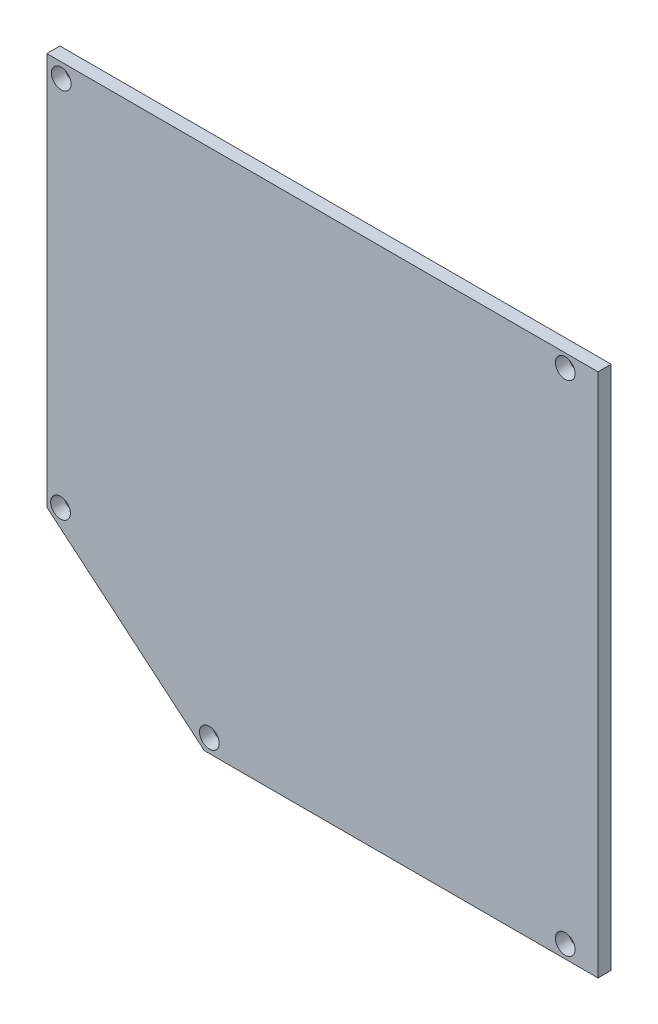
ISO-10303-21;
HEADER;
FILE_DESCRIPTION(('STEP AP214'),'2;1');
FILE_NAME('part.step','',(''),(''),'','','');
FILE_SCHEMA(('AUTOMOTIVE_DESIGN { 1 0 10303 214 1 1 1 1 }'));
ENDSEC;
DATA;
#1=APPLICATION_CONTEXT('core data for automotive mechanical design processes');
#2=APPLICATION_PROTOCOL_DEFINITION('international standard','automotive_design',2000,#1);
#3=PRODUCT_CONTEXT('',#1,'mechanical');
#4=PRODUCT('Part','Part','',(#3));
#5=PRODUCT_RELATED_PRODUCT_CATEGORY('part','',(#4));
#6=PRODUCT_DEFINITION_FORMATION('','',#4);
#7=PRODUCT_DEFINITION_CONTEXT('part definition',#1,'design');
#8=PRODUCT_DEFINITION('design','',#6,#7);
#9=PRODUCT_DEFINITION_SHAPE('','',#8);
#10=(LENGTH_UNIT() NAMED_UNIT(*) SI_UNIT(.MILLI.,.METRE.));
#11=(NAMED_UNIT(*) PLANE_ANGLE_UNIT() SI_UNIT($,.RADIAN.));
#12=(NAMED_UNIT(*) SI_UNIT($,.STERADIAN.) SOLID_ANGLE_UNIT());
#13=UNCERTAINTY_MEASURE_WITH_UNIT(LENGTH_MEASURE(1.E-05),#10,'distance_accuracy_value','');
#14=(GEOMETRIC_REPRESENTATION_CONTEXT(3) GLOBAL_UNCERTAINTY_ASSIGNED_CONTEXT((#13)) GLOBAL_UNIT_ASSIGNED_CONTEXT((#10,
#11,#12)) REPRESENTATION_CONTEXT('',''));
#15=CARTESIAN_POINT('',(0.,0.,0.));
#16=DIRECTION('',(0.,0.,1.));
#17=DIRECTION('',(1.,0.,0.));
#18=AXIS2_PLACEMENT_3D('',#15,#16,#17);
#19=CARTESIAN_POINT('',(0.,0.,2.));
#20=DIRECTION('',(0.642787609686534,0.766044443118982,0.));
#21=DIRECTION('',(-0.766044443118982,0.642787609686534,0.));
#22=AXIS2_PLACEMENT_3D('',#19,#20,#21);
#23=PLANE('',#22);
#24=DIRECTION('',(0.766044443118982,-0.642787609686534,0.));
#25=VECTOR('',#24,1.);
#26=CARTESIAN_POINT('',(0.,0.,0.));
#27=LINE('',#26,#25);
#28=CARTESIAN_POINT('',(-24.,20.1383911482545,0.));
#29=VERTEX_POINT('',#28);
#30=CARTESIAN_POINT('',(0.,0.,0.));
#31=VERTEX_POINT('',#30);
#32=EDGE_CURVE('E120',#29,#31,#27,.T.);
#33=ORIENTED_EDGE('',*,*,#32,.T.);
#34=DIRECTION('',(0.,0.,-1.));
#35=VECTOR('',#34,1.);
#36=CARTESIAN_POINT('',(0.,0.,2.));
#37=LINE('',#36,#35);
#38=CARTESIAN_POINT('',(0.,0.,2.));
#39=VERTEX_POINT('',#38);
#40=EDGE_CURVE('E11',#39,#31,#37,.T.);
#41=ORIENTED_EDGE('',*,*,#40,.F.);
#42=DIRECTION('',(0.766044443118982,-0.642787609686534,0.));
#43=VECTOR('',#42,1.);
#44=CARTESIAN_POINT('',(0.,0.,2.));
#45=LINE('',#44,#43);
#46=CARTESIAN_POINT('',(-24.,20.1383911482545,2.));
#47=VERTEX_POINT('',#46);
#48=EDGE_CURVE('E133',#47,#39,#45,.T.);
#49=ORIENTED_EDGE('',*,*,#48,.F.);
#50=DIRECTION('',(0.,0.,-1.));
#51=VECTOR('',#50,1.);
#52=CARTESIAN_POINT('',(-24.,20.1383911482545,2.));
#53=LINE('',#52,#51);
#54=EDGE_CURVE('E116',#47,#29,#53,.T.);
#55=ORIENTED_EDGE('',*,*,#54,.T.);
#56=EDGE_LOOP('',(#33,#41,#49,#55));
#57=FACE_BOUND('',#56,.T.);
#58=ADVANCED_FACE('F39',(#57),#23,.F.);
#59=CARTESIAN_POINT('',(0.,0.,2.));
#60=DIRECTION('',(0.,1.,0.));
#61=DIRECTION('',(0.,0.,1.));
#62=AXIS2_PLACEMENT_3D('',#59,#60,#61);
#63=PLANE('',#62);
#64=DIRECTION('',(1.,0.,0.));
#65=VECTOR('',#64,1.);
#66=CARTESIAN_POINT('',(0.,0.,0.));
#67=LINE('',#66,#65);
#68=CARTESIAN_POINT('',(60.,0.,0.));
#69=VERTEX_POINT('',#68);
#70=EDGE_CURVE('E124',#31,#69,#67,.T.);
#71=ORIENTED_EDGE('',*,*,#70,.T.);
#72=DIRECTION('',(0.,0.,-1.));
#73=VECTOR('',#72,1.);
#74=CARTESIAN_POINT('',(60.,0.,2.));
#75=LINE('',#74,#73);
#76=CARTESIAN_POINT('',(60.,0.,2.));
#77=VERTEX_POINT('',#76);
#78=EDGE_CURVE('E49',#77,#69,#75,.T.);
#79=ORIENTED_EDGE('',*,*,#78,.F.);
#80=DIRECTION('',(1.,0.,0.));
#81=VECTOR('',#80,1.);
#82=CARTESIAN_POINT('',(0.,0.,2.));
#83=LINE('',#82,#81);
#84=EDGE_CURVE('E92',#39,#77,#83,.T.);
#85=ORIENTED_EDGE('',*,*,#84,.F.);
#86=ORIENTED_EDGE('',*,*,#40,.T.);
#87=EDGE_LOOP('',(#71,#79,#85,#86));
#88=FACE_BOUND('',#87,.T.);
#89=ADVANCED_FACE('F191',(#88),#63,.F.);
#90=CARTESIAN_POINT('',(60.,80.,2.));
#91=DIRECTION('',(-1.,0.,0.));
#92=DIRECTION('',(0.,0.,1.));
#93=AXIS2_PLACEMENT_3D('',#90,#91,#92);
#94=PLANE('',#93);
#95=DIRECTION('',(0.,1.,0.));
#96=VECTOR('',#95,1.);
#97=CARTESIAN_POINT('',(60.,80.,0.));
#98=LINE('',#97,#96);
#99=CARTESIAN_POINT('',(60.,80.,0.));
#100=VERTEX_POINT('',#99);
#101=EDGE_CURVE('E108',#69,#100,#98,.T.);
#102=ORIENTED_EDGE('',*,*,#101,.T.);
#103=DIRECTION('',(0.,0.,-1.));
#104=VECTOR('',#103,1.);
#105=CARTESIAN_POINT('',(60.,80.,2.));
#106=LINE('',#105,#104);
#107=CARTESIAN_POINT('',(60.,80.,2.));
#108=VERTEX_POINT('',#107);
#109=EDGE_CURVE('E105',#108,#100,#106,.T.);
#110=ORIENTED_EDGE('',*,*,#109,.F.);
#111=DIRECTION('',(0.,1.,0.));
#112=VECTOR('',#111,1.);
#113=CARTESIAN_POINT('',(60.,80.,2.));
#114=LINE('',#113,#112);
#115=EDGE_CURVE('E96',#77,#108,#114,.T.);
#116=ORIENTED_EDGE('',*,*,#115,.F.);
#117=ORIENTED_EDGE('',*,*,#78,.T.);
#118=EDGE_LOOP('',(#102,#110,#116,#117));
#119=FACE_BOUND('',#118,.T.);
#120=ADVANCED_FACE('F106',(#119),#94,.F.);
#121=CARTESIAN_POINT('',(-24.,80.,2.));
#122=DIRECTION('',(0.,-1.,0.));
#123=DIRECTION('',(0.,0.,-1.));
#124=AXIS2_PLACEMENT_3D('',#121,#122,#123);
#125=PLANE('',#124);
#126=DIRECTION('',(-1.,0.,0.));
#127=VECTOR('',#126,1.);
#128=CARTESIAN_POINT('',(-24.,80.,0.));
#129=LINE('',#128,#127);
#130=CARTESIAN_POINT('',(-24.,80.,0.));
#131=VERTEX_POINT('',#130);
#132=EDGE_CURVE('E78',#100,#131,#129,.T.);
#133=ORIENTED_EDGE('',*,*,#132,.T.);
#134=DIRECTION('',(0.,0.,-1.));
#135=VECTOR('',#134,1.);
#136=CARTESIAN_POINT('',(-24.,80.,2.));
#137=LINE('',#136,#135);
#138=CARTESIAN_POINT('',(-24.,80.,2.));
#139=VERTEX_POINT('',#138);
#140=EDGE_CURVE('E110',#139,#131,#137,.T.);
#141=ORIENTED_EDGE('',*,*,#140,.F.);
#142=DIRECTION('',(-1.,0.,0.));
#143=VECTOR('',#142,1.);
#144=CARTESIAN_POINT('',(-24.,80.,2.));
#145=LINE('',#144,#143);
#146=EDGE_CURVE('E100',#108,#139,#145,.T.);
#147=ORIENTED_EDGE('',*,*,#146,.F.);
#148=ORIENTED_EDGE('',*,*,#109,.T.);
#149=EDGE_LOOP('',(#133,#141,#147,#148));
#150=FACE_BOUND('',#149,.T.);
#151=ADVANCED_FACE('F112',(#150),#125,.F.);
#152=CARTESIAN_POINT('',(-24.,20.1383911482545,2.));
#153=DIRECTION('',(1.,0.,0.));
#154=DIRECTION('',(0.,1.,0.));
#155=AXIS2_PLACEMENT_3D('',#152,#153,#154);
#156=PLANE('',#155);
#157=DIRECTION('',(0.,-1.,0.));
#158=VECTOR('',#157,1.);
#159=CARTESIAN_POINT('',(-24.,20.1383911482545,0.));
#160=LINE('',#159,#158);
#161=EDGE_CURVE('E84',#131,#29,#160,.T.);
#162=ORIENTED_EDGE('',*,*,#161,.T.);
#163=ORIENTED_EDGE('',*,*,#54,.F.);
#164=DIRECTION('',(0.,-1.,0.));
#165=VECTOR('',#164,1.);
#166=CARTESIAN_POINT('',(-24.,20.1383911482545,2.));
#167=LINE('',#166,#165);
#168=EDGE_CURVE('E58',#139,#47,#167,.T.);
#169=ORIENTED_EDGE('',*,*,#168,.F.);
#170=ORIENTED_EDGE('',*,*,#140,.T.);
#171=EDGE_LOOP('',(#162,#163,#169,#170));
#172=FACE_BOUND('',#171,.T.);
#173=ADVANCED_FACE('F180',(#172),#156,.F.);
#174=CARTESIAN_POINT('',(0.,0.,2.));
#175=DIRECTION('',(0.,0.,-1.));
#176=DIRECTION('',(-1.,0.,0.));
#177=AXIS2_PLACEMENT_3D('',#174,#175,#176);
#178=PLANE('',#177);
#179=CARTESIAN_POINT('',(55.,2.,2.));
#180=DIRECTION('',(0.,0.,1.));
#181=DIRECTION('',(1.,0.,0.));
#182=AXIS2_PLACEMENT_3D('',#179,#180,#181);
#183=CIRCLE('',#182,1.5);
#184=CARTESIAN_POINT('',(56.5,2.,2.));
#185=VERTEX_POINT('',#184);
#186=EDGE_CURVE('E280',#185,#185,#183,.T.);
#187=ORIENTED_EDGE('',*,*,#186,.F.);
#188=EDGE_LOOP('',(#187));
#189=FACE_BOUND('',#188,.T.);
#190=CARTESIAN_POINT('',(55.,78.,2.));
#191=DIRECTION('',(0.,0.,1.));
#192=DIRECTION('',(1.,0.,0.));
#193=AXIS2_PLACEMENT_3D('',#190,#191,#192);
#194=CIRCLE('',#193,1.5);
#195=CARTESIAN_POINT('',(56.5,78.,2.));
#196=VERTEX_POINT('',#195);
#197=EDGE_CURVE('E276',#196,#196,#194,.T.);
#198=ORIENTED_EDGE('',*,*,#197,.F.);
#199=EDGE_LOOP('',(#198));
#200=FACE_BOUND('',#199,.T.);
#201=CARTESIAN_POINT('',(0.764337491959019,2.1,2.));
#202=DIRECTION('',(0.,0.,1.));
#203=DIRECTION('',(1.,0.,0.));
#204=AXIS2_PLACEMENT_3D('',#201,#202,#203);
#205=CIRCLE('',#204,1.5);
#206=CARTESIAN_POINT('',(2.26433749195902,2.1,2.));
#207=VERTEX_POINT('',#206);
#208=EDGE_CURVE('E279',#207,#207,#205,.T.);
#209=ORIENTED_EDGE('',*,*,#208,.F.);
#210=EDGE_LOOP('',(#209));
#211=FACE_BOUND('',#210,.T.);
#212=CARTESIAN_POINT('',(-21.9154920898157,21.1104131502581,2.));
#213=DIRECTION('',(0.,0.,1.));
#214=DIRECTION('',(1.,0.,0.));
#215=AXIS2_PLACEMENT_3D('',#212,#213,#214);
#216=CIRCLE('',#215,1.5);
#217=CARTESIAN_POINT('',(-20.4154920898157,21.1104131502581,2.));
#218=VERTEX_POINT('',#217);
#219=EDGE_CURVE('E285',#218,#218,#216,.T.);
#220=ORIENTED_EDGE('',*,*,#219,.F.);
#221=EDGE_LOOP('',(#220));
#222=FACE_BOUND('',#221,.T.);
#223=CARTESIAN_POINT('',(-21.8079689783217,77.8079689783217,2.));
#224=DIRECTION('',(0.,0.,1.));
#225=DIRECTION('',(1.,0.,0.));
#226=AXIS2_PLACEMENT_3D('',#223,#224,#225);
#227=CIRCLE('',#226,1.5);
#228=CARTESIAN_POINT('',(-20.3079689783217,77.8079689783217,2.));
#229=VERTEX_POINT('',#228);
#230=EDGE_CURVE('E145',#229,#229,#227,.T.);
#231=ORIENTED_EDGE('',*,*,#230,.F.);
#232=EDGE_LOOP('',(#231));
#233=FACE_BOUND('',#232,.T.);
#234=ORIENTED_EDGE('',*,*,#48,.T.);
#235=ORIENTED_EDGE('',*,*,#84,.T.);
#236=ORIENTED_EDGE('',*,*,#115,.T.);
#237=ORIENTED_EDGE('',*,*,#146,.T.);
#238=ORIENTED_EDGE('',*,*,#168,.T.);
#239=EDGE_LOOP('',(#234,#235,#236,#237,#238));
#240=FACE_BOUND('',#239,.T.);
#241=ADVANCED_FACE('F98',(#189,#200,#211,#222,#233,#240),#178,.F.);
#242=CARTESIAN_POINT('',(0.,0.,0.));
#243=DIRECTION('',(0.,0.,-1.));
#244=DIRECTION('',(-1.,0.,0.));
#245=AXIS2_PLACEMENT_3D('',#242,#243,#244);
#246=PLANE('',#245);
#247=CARTESIAN_POINT('',(55.,2.,0.));
#248=DIRECTION('',(0.,0.,-1.));
#249=DIRECTION('',(-1.,0.,0.));
#250=AXIS2_PLACEMENT_3D('',#247,#248,#249);
#251=CIRCLE('',#250,1.5);
#252=CARTESIAN_POINT('',(53.5,2.,0.));
#253=VERTEX_POINT('',#252);
#254=EDGE_CURVE('E42',#253,#253,#251,.T.);
#255=ORIENTED_EDGE('',*,*,#254,.F.);
#256=EDGE_LOOP('',(#255));
#257=FACE_BOUND('',#256,.T.);
#258=CARTESIAN_POINT('',(55.,78.,0.));
#259=DIRECTION('',(0.,0.,-1.));
#260=DIRECTION('',(-1.,0.,0.));
#261=AXIS2_PLACEMENT_3D('',#258,#259,#260);
#262=CIRCLE('',#261,1.5);
#263=CARTESIAN_POINT('',(53.5,78.,0.));
#264=VERTEX_POINT('',#263);
#265=EDGE_CURVE('E152',#264,#264,#262,.T.);
#266=ORIENTED_EDGE('',*,*,#265,.F.);
#267=EDGE_LOOP('',(#266));
#268=FACE_BOUND('',#267,.T.);
#269=CARTESIAN_POINT('',(0.764337491959019,2.1,0.));
#270=DIRECTION('',(0.,0.,-1.));
#271=DIRECTION('',(-1.,0.,0.));
#272=AXIS2_PLACEMENT_3D('',#269,#270,#271);
#273=CIRCLE('',#272,1.5);
#274=CARTESIAN_POINT('',(-0.735662508040981,2.1,0.));
#275=VERTEX_POINT('',#274);
#276=EDGE_CURVE('E149',#275,#275,#273,.T.);
#277=ORIENTED_EDGE('',*,*,#276,.F.);
#278=EDGE_LOOP('',(#277));
#279=FACE_BOUND('',#278,.T.);
#280=CARTESIAN_POINT('',(-21.9154920898157,21.1104131502581,0.));
#281=DIRECTION('',(0.,0.,-1.));
#282=DIRECTION('',(-1.,0.,0.));
#283=AXIS2_PLACEMENT_3D('',#280,#281,#282);
#284=CIRCLE('',#283,1.5);
#285=CARTESIAN_POINT('',(-23.4154920898157,21.1104131502581,0.));
#286=VERTEX_POINT('',#285);
#287=EDGE_CURVE('E144',#286,#286,#284,.T.);
#288=ORIENTED_EDGE('',*,*,#287,.F.);
#289=EDGE_LOOP('',(#288));
#290=FACE_BOUND('',#289,.T.);
#291=CARTESIAN_POINT('',(-21.8079689783217,77.8079689783217,0.));
#292=DIRECTION('',(0.,0.,-1.));
#293=DIRECTION('',(-1.,0.,0.));
#294=AXIS2_PLACEMENT_3D('',#291,#292,#293);
#295=CIRCLE('',#294,1.5);
#296=CARTESIAN_POINT('',(-23.3079689783217,77.8079689783217,0.));
#297=VERTEX_POINT('',#296);
#298=EDGE_CURVE('E140',#297,#297,#295,.T.);
#299=ORIENTED_EDGE('',*,*,#298,.F.);
#300=EDGE_LOOP('',(#299));
#301=FACE_BOUND('',#300,.T.);
#302=ORIENTED_EDGE('',*,*,#32,.F.);
#303=ORIENTED_EDGE('',*,*,#161,.F.);
#304=ORIENTED_EDGE('',*,*,#132,.F.);
#305=ORIENTED_EDGE('',*,*,#101,.F.);
#306=ORIENTED_EDGE('',*,*,#70,.F.);
#307=EDGE_LOOP('',(#302,#303,#304,#305,#306));
#308=FACE_BOUND('',#307,.T.);
#309=ADVANCED_FACE('F164',(#257,#268,#279,#290,#301,#308),#246,.T.);
#310=CARTESIAN_POINT('',(-21.8079689783217,77.8079689783217,-4.));
#311=DIRECTION('',(0.,0.,1.));
#312=DIRECTION('',(1.,0.,0.));
#313=AXIS2_PLACEMENT_3D('',#310,#311,#312);
#314=CYLINDRICAL_SURFACE('',#313,1.5);
#315=ORIENTED_EDGE('',*,*,#298,.T.);
#316=EDGE_LOOP('',(#315));
#317=FACE_BOUND('',#316,.T.);
#318=ORIENTED_EDGE('',*,*,#230,.T.);
#319=EDGE_LOOP('',(#318));
#320=FACE_BOUND('',#319,.T.);
#321=ADVANCED_FACE('F167',(#317,#320),#314,.F.);
#322=CARTESIAN_POINT('',(-21.9154920898157,21.1104131502581,-4.));
#323=DIRECTION('',(0.,0.,1.));
#324=DIRECTION('',(1.,0.,0.));
#325=AXIS2_PLACEMENT_3D('',#322,#323,#324);
#326=CYLINDRICAL_SURFACE('',#325,1.5);
#327=ORIENTED_EDGE('',*,*,#287,.T.);
#328=EDGE_LOOP('',(#327));
#329=FACE_BOUND('',#328,.T.);
#330=ORIENTED_EDGE('',*,*,#219,.T.);
#331=EDGE_LOOP('',(#330));
#332=FACE_BOUND('',#331,.T.);
#333=ADVANCED_FACE('F232',(#329,#332),#326,.F.);
#334=CARTESIAN_POINT('',(0.764337491959019,2.1,-4.));
#335=DIRECTION('',(0.,0.,1.));
#336=DIRECTION('',(1.,0.,0.));
#337=AXIS2_PLACEMENT_3D('',#334,#335,#336);
#338=CYLINDRICAL_SURFACE('',#337,1.5);
#339=ORIENTED_EDGE('',*,*,#276,.T.);
#340=EDGE_LOOP('',(#339));
#341=FACE_BOUND('',#340,.T.);
#342=ORIENTED_EDGE('',*,*,#208,.T.);
#343=EDGE_LOOP('',(#342));
#344=FACE_BOUND('',#343,.T.);
#345=ADVANCED_FACE('F242',(#341,#344),#338,.F.);
#346=CARTESIAN_POINT('',(55.,78.,-4.));
#347=DIRECTION('',(0.,0.,1.));
#348=DIRECTION('',(1.,0.,0.));
#349=AXIS2_PLACEMENT_3D('',#346,#347,#348);
#350=CYLINDRICAL_SURFACE('',#349,1.5);
#351=ORIENTED_EDGE('',*,*,#265,.T.);
#352=EDGE_LOOP('',(#351));
#353=FACE_BOUND('',#352,.T.);
#354=ORIENTED_EDGE('',*,*,#197,.T.);
#355=EDGE_LOOP('',(#354));
#356=FACE_BOUND('',#355,.T.);
#357=ADVANCED_FACE('F252',(#353,#356),#350,.F.);
#358=CARTESIAN_POINT('',(55.,2.,-4.));
#359=DIRECTION('',(0.,0.,1.));
#360=DIRECTION('',(1.,0.,0.));
#361=AXIS2_PLACEMENT_3D('',#358,#359,#360);
#362=CYLINDRICAL_SURFACE('',#361,1.5);
#363=ORIENTED_EDGE('',*,*,#254,.T.);
#364=EDGE_LOOP('',(#363));
#365=FACE_BOUND('',#364,.T.);
#366=ORIENTED_EDGE('',*,*,#186,.T.);
#367=EDGE_LOOP('',(#366));
#368=FACE_BOUND('',#367,.T.);
#369=ADVANCED_FACE('F161',(#365,#368),#362,.F.);
#370=CLOSED_SHELL('',(#58,#89,#120,#151,#173,#241,#309,#321,#333,#345,#357,#369));
#371=MANIFOLD_SOLID_BREP('B2',#370);
#372=ADVANCED_BREP_SHAPE_REPRESENTATION('',(#18,#371),#14);
#373=SHAPE_DEFINITION_REPRESENTATION(#9,#372);
ENDSEC;
END-ISO-10303-21;
